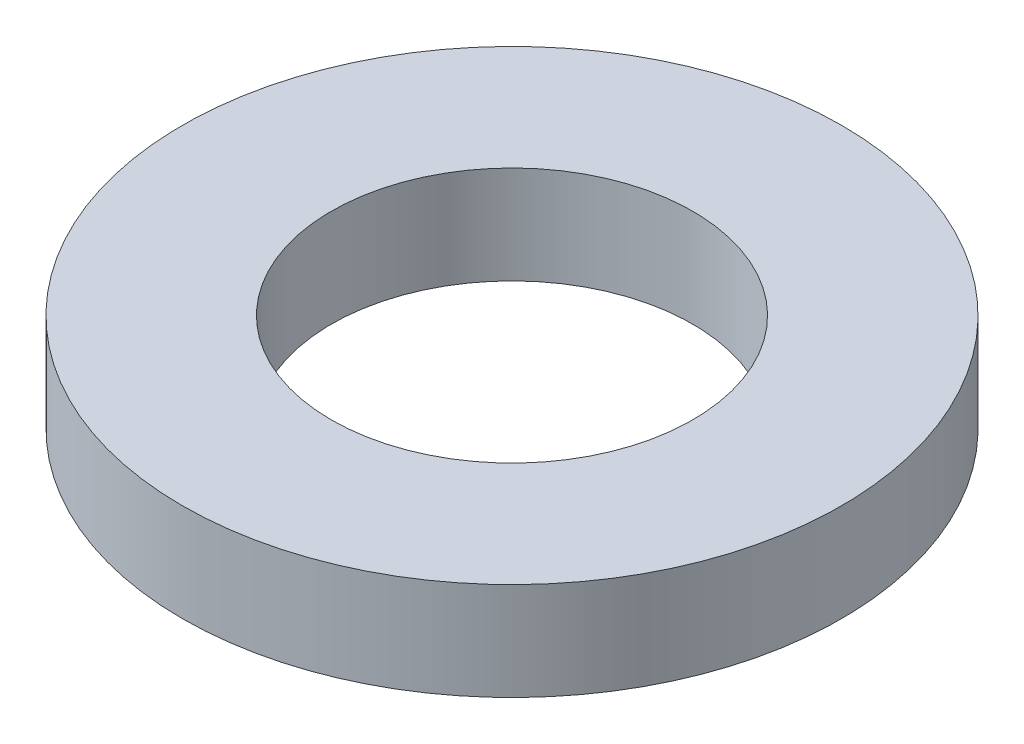
ISO-10303-21;
HEADER;
FILE_DESCRIPTION(('STEP AP214'),'2;1');
FILE_NAME('part.step','',(''),(''),'','','');
FILE_SCHEMA(('AUTOMOTIVE_DESIGN { 1 0 10303 214 1 1 1 1 }'));
ENDSEC;
DATA;
#1=APPLICATION_CONTEXT('core data for automotive mechanical design processes');
#2=APPLICATION_PROTOCOL_DEFINITION('international standard','automotive_design',2000,#1);
#3=PRODUCT_CONTEXT('',#1,'mechanical');
#4=PRODUCT('Part','Part','',(#3));
#5=PRODUCT_RELATED_PRODUCT_CATEGORY('part','',(#4));
#6=PRODUCT_DEFINITION_FORMATION('','',#4);
#7=PRODUCT_DEFINITION_CONTEXT('part definition',#1,'design');
#8=PRODUCT_DEFINITION('design','',#6,#7);
#9=PRODUCT_DEFINITION_SHAPE('','',#8);
#10=(LENGTH_UNIT() NAMED_UNIT(*) SI_UNIT(.MILLI.,.METRE.));
#11=(NAMED_UNIT(*) PLANE_ANGLE_UNIT() SI_UNIT($,.RADIAN.));
#12=(NAMED_UNIT(*) SI_UNIT($,.STERADIAN.) SOLID_ANGLE_UNIT());
#13=UNCERTAINTY_MEASURE_WITH_UNIT(LENGTH_MEASURE(1.E-05),#10,'distance_accuracy_value','');
#14=(GEOMETRIC_REPRESENTATION_CONTEXT(3) GLOBAL_UNCERTAINTY_ASSIGNED_CONTEXT((#13)) GLOBAL_UNIT_ASSIGNED_CONTEXT((#10,
#11,#12)) REPRESENTATION_CONTEXT('',''));
#15=CARTESIAN_POINT('',(0.,0.,0.));
#16=DIRECTION('',(0.,0.,1.));
#17=DIRECTION('',(1.,0.,0.));
#18=AXIS2_PLACEMENT_3D('',#15,#16,#17);
#19=CARTESIAN_POINT('',(0.,23.,0.));
#20=DIRECTION('',(0.,-1.,0.));
#21=DIRECTION('',(0.,0.,-1.));
#22=AXIS2_PLACEMENT_3D('',#19,#20,#21);
#23=CYLINDRICAL_SURFACE('',#22,77.5);
#24=CARTESIAN_POINT('',(0.,23.,0.));
#25=DIRECTION('',(0.,1.,0.));
#26=DIRECTION('',(0.,0.,1.));
#27=AXIS2_PLACEMENT_3D('',#24,#25,#26);
#28=CIRCLE('',#27,77.5);
#29=CARTESIAN_POINT('',(0.,23.,77.5));
#30=VERTEX_POINT('',#29);
#31=EDGE_CURVE('E10',#30,#30,#28,.T.);
#32=ORIENTED_EDGE('',*,*,#31,.F.);
#33=EDGE_LOOP('',(#32));
#34=FACE_BOUND('',#33,.T.);
#35=CARTESIAN_POINT('',(0.,0.,0.));
#36=DIRECTION('',(0.,1.,0.));
#37=DIRECTION('',(0.,0.,1.));
#38=AXIS2_PLACEMENT_3D('',#35,#36,#37);
#39=CIRCLE('',#38,77.5);
#40=CARTESIAN_POINT('',(0.,0.,77.5));
#41=VERTEX_POINT('',#40);
#42=EDGE_CURVE('E37',#41,#41,#39,.T.);
#43=ORIENTED_EDGE('',*,*,#42,.T.);
#44=EDGE_LOOP('',(#43));
#45=FACE_BOUND('',#44,.T.);
#46=ADVANCED_FACE('F40',(#34,#45),#23,.T.);
#47=CARTESIAN_POINT('',(0.,23.,0.));
#48=DIRECTION('',(0.,1.,0.));
#49=DIRECTION('',(0.,0.,1.));
#50=AXIS2_PLACEMENT_3D('',#47,#48,#49);
#51=PLANE('',#50);
#52=CARTESIAN_POINT('',(0.,23.,0.));
#53=DIRECTION('',(0.,1.,0.));
#54=DIRECTION('',(0.,0.,1.));
#55=AXIS2_PLACEMENT_3D('',#52,#53,#54);
#56=CIRCLE('',#55,42.5);
#57=CARTESIAN_POINT('',(0.,23.,42.5));
#58=VERTEX_POINT('',#57);
#59=EDGE_CURVE('E50',#58,#58,#56,.T.);
#60=ORIENTED_EDGE('',*,*,#59,.F.);
#61=EDGE_LOOP('',(#60));
#62=FACE_BOUND('',#61,.T.);
#63=ORIENTED_EDGE('',*,*,#31,.T.);
#64=EDGE_LOOP('',(#63));
#65=FACE_BOUND('',#64,.T.);
#66=ADVANCED_FACE('F59',(#62,#65),#51,.T.);
#67=CARTESIAN_POINT('',(0.,0.,0.));
#68=DIRECTION('',(0.,1.,0.));
#69=DIRECTION('',(0.,0.,1.));
#70=AXIS2_PLACEMENT_3D('',#67,#68,#69);
#71=PLANE('',#70);
#72=CARTESIAN_POINT('',(0.,0.,0.));
#73=DIRECTION('',(0.,1.,0.));
#74=DIRECTION('',(0.,0.,1.));
#75=AXIS2_PLACEMENT_3D('',#72,#73,#74);
#76=CIRCLE('',#75,42.5);
#77=CARTESIAN_POINT('',(0.,0.,42.5));
#78=VERTEX_POINT('',#77);
#79=EDGE_CURVE('E47',#78,#78,#76,.T.);
#80=ORIENTED_EDGE('',*,*,#79,.T.);
#81=EDGE_LOOP('',(#80));
#82=FACE_BOUND('',#81,.T.);
#83=ORIENTED_EDGE('',*,*,#42,.F.);
#84=EDGE_LOOP('',(#83));
#85=FACE_BOUND('',#84,.T.);
#86=ADVANCED_FACE('F58',(#82,#85),#71,.F.);
#87=CARTESIAN_POINT('',(0.,23.,0.));
#88=DIRECTION('',(0.,-1.,0.));
#89=DIRECTION('',(0.,0.,-1.));
#90=AXIS2_PLACEMENT_3D('',#87,#88,#89);
#91=CYLINDRICAL_SURFACE('',#90,42.5);
#92=ORIENTED_EDGE('',*,*,#59,.T.);
#93=EDGE_LOOP('',(#92));
#94=FACE_BOUND('',#93,.T.);
#95=ORIENTED_EDGE('',*,*,#79,.F.);
#96=EDGE_LOOP('',(#95));
#97=FACE_BOUND('',#96,.T.);
#98=ADVANCED_FACE('F54',(#94,#97),#91,.F.);
#99=CLOSED_SHELL('',(#46,#66,#86,#98));
#100=MANIFOLD_SOLID_BREP('B2',#99);
#101=ADVANCED_BREP_SHAPE_REPRESENTATION('',(#18,#100),#14);
#102=SHAPE_DEFINITION_REPRESENTATION(#9,#101);
ENDSEC;
END-ISO-10303-21;
